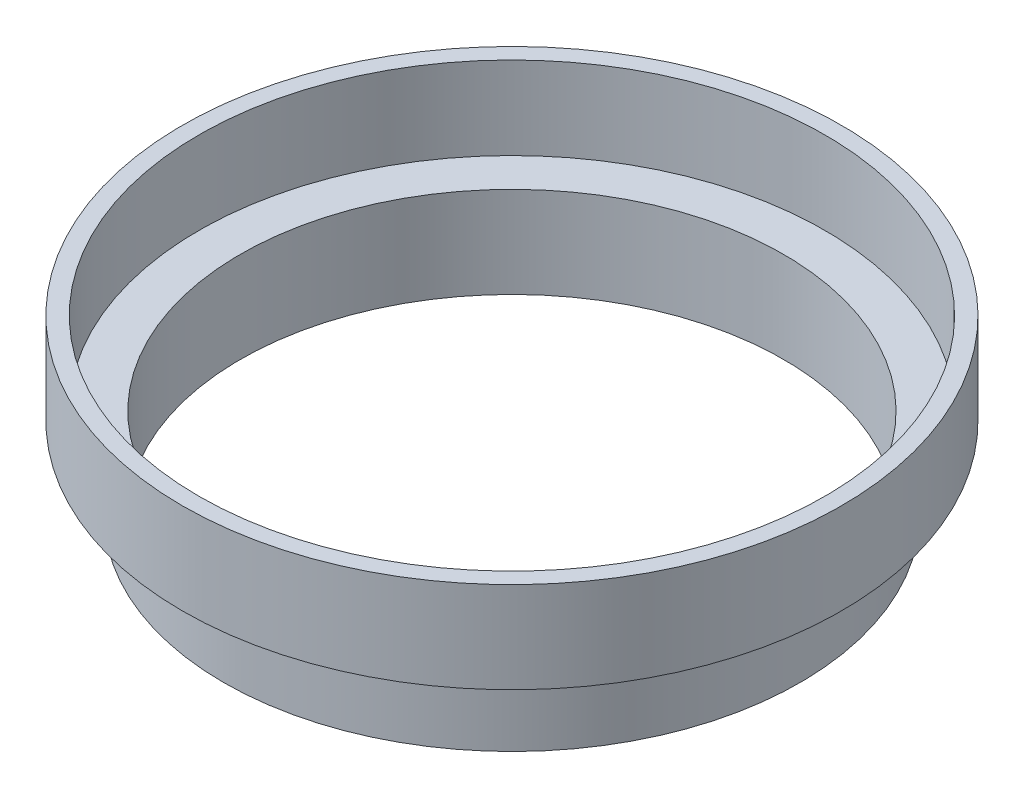
ISO-10303-21;
HEADER;
FILE_DESCRIPTION(('STEP AP214'),'2;1');
FILE_NAME('part.step','',(''),(''),'','','');
FILE_SCHEMA(('AUTOMOTIVE_DESIGN { 1 0 10303 214 1 1 1 1 }'));
ENDSEC;
DATA;
#1=APPLICATION_CONTEXT('core data for automotive mechanical design processes');
#2=APPLICATION_PROTOCOL_DEFINITION('international standard','automotive_design',2000,#1);
#3=PRODUCT_CONTEXT('',#1,'mechanical');
#4=PRODUCT('Part','Part','',(#3));
#5=PRODUCT_RELATED_PRODUCT_CATEGORY('part','',(#4));
#6=PRODUCT_DEFINITION_FORMATION('','',#4);
#7=PRODUCT_DEFINITION_CONTEXT('part definition',#1,'design');
#8=PRODUCT_DEFINITION('design','',#6,#7);
#9=PRODUCT_DEFINITION_SHAPE('','',#8);
#10=(LENGTH_UNIT() NAMED_UNIT(*) SI_UNIT(.MILLI.,.METRE.));
#11=(NAMED_UNIT(*) PLANE_ANGLE_UNIT() SI_UNIT($,.RADIAN.));
#12=(NAMED_UNIT(*) SI_UNIT($,.STERADIAN.) SOLID_ANGLE_UNIT());
#13=UNCERTAINTY_MEASURE_WITH_UNIT(LENGTH_MEASURE(1.E-05),#10,'distance_accuracy_value','');
#14=(GEOMETRIC_REPRESENTATION_CONTEXT(3) GLOBAL_UNCERTAINTY_ASSIGNED_CONTEXT((#13)) GLOBAL_UNIT_ASSIGNED_CONTEXT((#10,
#11,#12)) REPRESENTATION_CONTEXT('',''));
#15=CARTESIAN_POINT('',(0.,0.,0.));
#16=DIRECTION('',(0.,0.,1.));
#17=DIRECTION('',(1.,0.,0.));
#18=AXIS2_PLACEMENT_3D('',#15,#16,#17);
#19=CARTESIAN_POINT('',(0.,13.97,0.));
#20=DIRECTION('',(0.,1.,0.));
#21=DIRECTION('',(0.,0.,1.));
#22=AXIS2_PLACEMENT_3D('',#19,#20,#21);
#23=PLANE('',#22);
#24=CARTESIAN_POINT('',(0.,13.97,0.));
#25=DIRECTION('',(0.,1.,0.));
#26=DIRECTION('',(0.,0.,1.));
#27=AXIS2_PLACEMENT_3D('',#24,#25,#26);
#28=CIRCLE('',#27,41.6814);
#29=CARTESIAN_POINT('',(0.,13.97,41.6814));
#30=VERTEX_POINT('',#29);
#31=EDGE_CURVE('E65',#30,#30,#28,.T.);
#32=ORIENTED_EDGE('',*,*,#31,.F.);
#33=EDGE_LOOP('',(#32));
#34=FACE_BOUND('',#33,.T.);
#35=CARTESIAN_POINT('',(0.,13.97,0.));
#36=DIRECTION('',(0.,1.,0.));
#37=DIRECTION('',(0.,0.,1.));
#38=AXIS2_PLACEMENT_3D('',#35,#36,#37);
#39=CIRCLE('',#38,48.0314);
#40=CARTESIAN_POINT('',(0.,13.97,48.0314));
#41=VERTEX_POINT('',#40);
#42=EDGE_CURVE('E10',#41,#41,#39,.F.);
#43=ORIENTED_EDGE('',*,*,#42,.F.);
#44=EDGE_LOOP('',(#43));
#45=FACE_BOUND('',#44,.T.);
#46=ADVANCED_FACE('F37',(#34,#45),#23,.T.);
#47=CARTESIAN_POINT('',(0.,0.,0.));
#48=DIRECTION('',(0.,1.,0.));
#49=DIRECTION('',(0.,0.,1.));
#50=AXIS2_PLACEMENT_3D('',#47,#48,#49);
#51=PLANE('',#50);
#52=CARTESIAN_POINT('',(0.,0.,0.));
#53=DIRECTION('',(0.,1.,0.));
#54=DIRECTION('',(0.,0.,1.));
#55=AXIS2_PLACEMENT_3D('',#52,#53,#54);
#56=CIRCLE('',#55,44.2214);
#57=CARTESIAN_POINT('',(0.,0.,44.2214));
#58=VERTEX_POINT('',#57);
#59=EDGE_CURVE('E51',#58,#58,#56,.T.);
#60=ORIENTED_EDGE('',*,*,#59,.F.);
#61=EDGE_LOOP('',(#60));
#62=FACE_BOUND('',#61,.T.);
#63=CARTESIAN_POINT('',(0.,0.,0.));
#64=DIRECTION('',(0.,1.,0.));
#65=DIRECTION('',(0.,0.,1.));
#66=AXIS2_PLACEMENT_3D('',#63,#64,#65);
#67=CIRCLE('',#66,41.6814);
#68=CARTESIAN_POINT('',(0.,0.,41.6814));
#69=VERTEX_POINT('',#68);
#70=EDGE_CURVE('E58',#69,#69,#67,.T.);
#71=ORIENTED_EDGE('',*,*,#70,.T.);
#72=EDGE_LOOP('',(#71));
#73=FACE_BOUND('',#72,.T.);
#74=ADVANCED_FACE('F93',(#62,#73),#51,.F.);
#75=CARTESIAN_POINT('',(0.,12.7,0.));
#76=DIRECTION('',(0.,-1.,0.));
#77=DIRECTION('',(0.,0.,-1.));
#78=AXIS2_PLACEMENT_3D('',#75,#76,#77);
#79=CYLINDRICAL_SURFACE('',#78,44.2214);
#80=CARTESIAN_POINT('',(0.,12.7,0.));
#81=DIRECTION('',(0.,1.,0.));
#82=DIRECTION('',(0.,0.,1.));
#83=AXIS2_PLACEMENT_3D('',#80,#81,#82);
#84=CIRCLE('',#83,44.2214);
#85=CARTESIAN_POINT('',(0.,12.7,44.2214));
#86=VERTEX_POINT('',#85);
#87=EDGE_CURVE('E45',#86,#86,#84,.T.);
#88=ORIENTED_EDGE('',*,*,#87,.F.);
#89=EDGE_LOOP('',(#88));
#90=FACE_BOUND('',#89,.T.);
#91=ORIENTED_EDGE('',*,*,#59,.T.);
#92=EDGE_LOOP('',(#91));
#93=FACE_BOUND('',#92,.T.);
#94=ADVANCED_FACE('F39',(#90,#93),#79,.T.);
#95=CARTESIAN_POINT('',(0.,12.7,0.));
#96=DIRECTION('',(0.,-1.,0.));
#97=DIRECTION('',(0.,0.,-1.));
#98=AXIS2_PLACEMENT_3D('',#95,#96,#97);
#99=CYLINDRICAL_SURFACE('',#98,41.6814);
#100=ORIENTED_EDGE('',*,*,#70,.F.);
#101=EDGE_LOOP('',(#100));
#102=FACE_BOUND('',#101,.T.);
#103=ORIENTED_EDGE('',*,*,#31,.T.);
#104=EDGE_LOOP('',(#103));
#105=FACE_BOUND('',#104,.T.);
#106=ADVANCED_FACE('F103',(#102,#105),#99,.F.);
#107=CARTESIAN_POINT('',(0.,12.7,0.));
#108=DIRECTION('',(0.,1.,0.));
#109=DIRECTION('',(0.,0.,1.));
#110=AXIS2_PLACEMENT_3D('',#107,#108,#109);
#111=PLANE('',#110);
#112=ORIENTED_EDGE('',*,*,#87,.T.);
#113=EDGE_LOOP('',(#112));
#114=FACE_BOUND('',#113,.T.);
#115=CARTESIAN_POINT('',(0.,12.7,0.));
#116=DIRECTION('',(0.,1.,0.));
#117=DIRECTION('',(0.,0.,1.));
#118=AXIS2_PLACEMENT_3D('',#115,#116,#117);
#119=CIRCLE('',#118,50.5714);
#120=CARTESIAN_POINT('',(0.,12.7,50.5714));
#121=VERTEX_POINT('',#120);
#122=EDGE_CURVE('E62',#121,#121,#119,.T.);
#123=ORIENTED_EDGE('',*,*,#122,.F.);
#124=EDGE_LOOP('',(#123));
#125=FACE_BOUND('',#124,.T.);
#126=ADVANCED_FACE('F88',(#114,#125),#111,.F.);
#127=CARTESIAN_POINT('',(0.,13.97,0.));
#128=DIRECTION('',(0.,-1.,0.));
#129=DIRECTION('',(0.,0.,-1.));
#130=AXIS2_PLACEMENT_3D('',#127,#128,#129);
#131=CYLINDRICAL_SURFACE('',#130,50.5714);
#132=ORIENTED_EDGE('',*,*,#122,.T.);
#133=EDGE_LOOP('',(#132));
#134=FACE_BOUND('',#133,.T.);
#135=CARTESIAN_POINT('',(0.,26.67,0.));
#136=DIRECTION('',(0.,1.,0.));
#137=DIRECTION('',(0.,0.,1.));
#138=AXIS2_PLACEMENT_3D('',#135,#136,#137);
#139=CIRCLE('',#138,50.5714);
#140=CARTESIAN_POINT('',(0.,26.67,50.5714));
#141=VERTEX_POINT('',#140);
#142=EDGE_CURVE('E68',#141,#141,#139,.T.);
#143=ORIENTED_EDGE('',*,*,#142,.F.);
#144=EDGE_LOOP('',(#143));
#145=FACE_BOUND('',#144,.T.);
#146=ADVANCED_FACE('F80',(#134,#145),#131,.T.);
#147=CARTESIAN_POINT('',(0.,26.67,0.));
#148=DIRECTION('',(0.,1.,0.));
#149=DIRECTION('',(0.,0.,1.));
#150=AXIS2_PLACEMENT_3D('',#147,#148,#149);
#151=PLANE('',#150);
#152=ORIENTED_EDGE('',*,*,#142,.T.);
#153=EDGE_LOOP('',(#152));
#154=FACE_BOUND('',#153,.T.);
#155=CARTESIAN_POINT('',(0.,26.67,0.));
#156=DIRECTION('',(0.,1.,0.));
#157=DIRECTION('',(0.,0.,1.));
#158=AXIS2_PLACEMENT_3D('',#155,#156,#157);
#159=CIRCLE('',#158,48.0314);
#160=CARTESIAN_POINT('',(0.,26.67,48.0314));
#161=VERTEX_POINT('',#160);
#162=EDGE_CURVE('E72',#161,#161,#159,.T.);
#163=ORIENTED_EDGE('',*,*,#162,.F.);
#164=EDGE_LOOP('',(#163));
#165=FACE_BOUND('',#164,.T.);
#166=ADVANCED_FACE('F78',(#154,#165),#151,.T.);
#167=CARTESIAN_POINT('',(0.,26.67,0.));
#168=DIRECTION('',(0.,-1.,0.));
#169=DIRECTION('',(0.,0.,-1.));
#170=AXIS2_PLACEMENT_3D('',#167,#168,#169);
#171=CYLINDRICAL_SURFACE('',#170,48.0314);
#172=ORIENTED_EDGE('',*,*,#162,.T.);
#173=EDGE_LOOP('',(#172));
#174=FACE_BOUND('',#173,.T.);
#175=ORIENTED_EDGE('',*,*,#42,.T.);
#176=EDGE_LOOP('',(#175));
#177=FACE_BOUND('',#176,.T.);
#178=ADVANCED_FACE('F76',(#174,#177),#171,.F.);
#179=CLOSED_SHELL('',(#46,#74,#94,#106,#126,#146,#166,#178));
#180=MANIFOLD_SOLID_BREP('B2',#179);
#181=ADVANCED_BREP_SHAPE_REPRESENTATION('',(#18,#180),#14);
#182=SHAPE_DEFINITION_REPRESENTATION(#9,#181);
ENDSEC;
END-ISO-10303-21;
